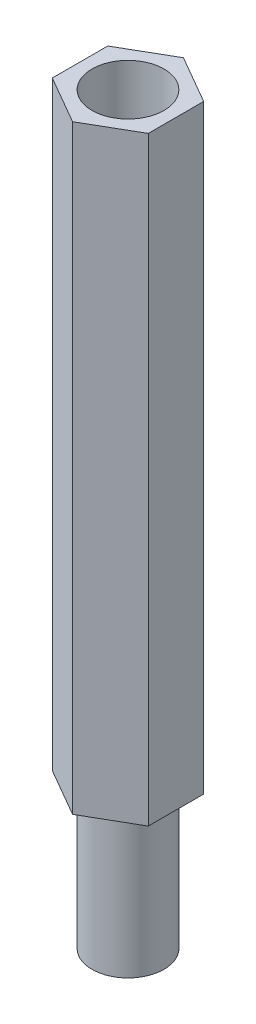
ISO-10303-21;
HEADER;
FILE_DESCRIPTION(('STEP AP214'),'2;1');
FILE_NAME('part.step','',(''),(''),'','','');
FILE_SCHEMA(('AUTOMOTIVE_DESIGN { 1 0 10303 214 1 1 1 1 }'));
ENDSEC;
DATA;
#1=APPLICATION_CONTEXT('core data for automotive mechanical design processes');
#2=APPLICATION_PROTOCOL_DEFINITION('international standard','automotive_design',2000,#1);
#3=PRODUCT_CONTEXT('',#1,'mechanical');
#4=PRODUCT('Part','Part','',(#3));
#5=PRODUCT_RELATED_PRODUCT_CATEGORY('part','',(#4));
#6=PRODUCT_DEFINITION_FORMATION('','',#4);
#7=PRODUCT_DEFINITION_CONTEXT('part definition',#1,'design');
#8=PRODUCT_DEFINITION('design','',#6,#7);
#9=PRODUCT_DEFINITION_SHAPE('','',#8);
#10=(LENGTH_UNIT() NAMED_UNIT(*) SI_UNIT(.MILLI.,.METRE.));
#11=(NAMED_UNIT(*) PLANE_ANGLE_UNIT() SI_UNIT($,.RADIAN.));
#12=(NAMED_UNIT(*) SI_UNIT($,.STERADIAN.) SOLID_ANGLE_UNIT());
#13=UNCERTAINTY_MEASURE_WITH_UNIT(LENGTH_MEASURE(1.E-05),#10,'distance_accuracy_value','');
#14=(GEOMETRIC_REPRESENTATION_CONTEXT(3) GLOBAL_UNCERTAINTY_ASSIGNED_CONTEXT((#13)) GLOBAL_UNIT_ASSIGNED_CONTEXT((#10,
#11,#12)) REPRESENTATION_CONTEXT('',''));
#15=CARTESIAN_POINT('',(0.,0.,0.));
#16=DIRECTION('',(0.,0.,1.));
#17=DIRECTION('',(1.,0.,0.));
#18=AXIS2_PLACEMENT_3D('',#15,#16,#17);
#19=CARTESIAN_POINT('',(-2.,25.,1.15470053837925));
#20=DIRECTION('',(0.5,0.,-0.866025403784439));
#21=DIRECTION('',(-0.866025403784439,0.,-0.5));
#22=AXIS2_PLACEMENT_3D('',#19,#20,#21);
#23=PLANE('',#22);
#24=DIRECTION('',(0.866025403784439,0.,0.5));
#25=VECTOR('',#24,1.);
#26=CARTESIAN_POINT('',(-2.,0.,1.15470053837925));
#27=LINE('',#26,#25);
#28=CARTESIAN_POINT('',(-2.,0.,1.15470053837925));
#29=VERTEX_POINT('',#28);
#30=CARTESIAN_POINT('',(0.,0.,2.3094010767585));
#31=VERTEX_POINT('',#30);
#32=EDGE_CURVE('E133',#29,#31,#27,.T.);
#33=ORIENTED_EDGE('',*,*,#32,.T.);
#34=DIRECTION('',(0.,-1.,0.));
#35=VECTOR('',#34,1.);
#36=CARTESIAN_POINT('',(0.,25.,2.3094010767585));
#37=LINE('',#36,#35);
#38=CARTESIAN_POINT('',(0.,25.,2.3094010767585));
#39=VERTEX_POINT('',#38);
#40=EDGE_CURVE('E50',#39,#31,#37,.T.);
#41=ORIENTED_EDGE('',*,*,#40,.F.);
#42=DIRECTION('',(0.866025403784439,0.,0.5));
#43=VECTOR('',#42,1.);
#44=CARTESIAN_POINT('',(-2.,25.,1.15470053837925));
#45=LINE('',#44,#43);
#46=CARTESIAN_POINT('',(-2.,25.,1.15470053837925));
#47=VERTEX_POINT('',#46);
#48=EDGE_CURVE('E144',#47,#39,#45,.T.);
#49=ORIENTED_EDGE('',*,*,#48,.F.);
#50=DIRECTION('',(0.,-1.,0.));
#51=VECTOR('',#50,1.);
#52=CARTESIAN_POINT('',(-2.,25.,1.15470053837925));
#53=LINE('',#52,#51);
#54=EDGE_CURVE('E129',#47,#29,#53,.T.);
#55=ORIENTED_EDGE('',*,*,#54,.T.);
#56=EDGE_LOOP('',(#33,#41,#49,#55));
#57=FACE_BOUND('',#56,.T.);
#58=ADVANCED_FACE('F47',(#57),#23,.F.);
#59=CARTESIAN_POINT('',(0.,25.,2.3094010767585));
#60=DIRECTION('',(-0.5,0.,-0.866025403784438));
#61=DIRECTION('',(-0.866025403784439,0.,0.5));
#62=AXIS2_PLACEMENT_3D('',#59,#60,#61);
#63=PLANE('',#62);
#64=DIRECTION('',(0.866025403784438,0.,-0.5));
#65=VECTOR('',#64,1.);
#66=CARTESIAN_POINT('',(0.,0.,2.3094010767585));
#67=LINE('',#66,#65);
#68=CARTESIAN_POINT('',(2.,0.,1.15470053837925));
#69=VERTEX_POINT('',#68);
#70=EDGE_CURVE('E136',#31,#69,#67,.T.);
#71=ORIENTED_EDGE('',*,*,#70,.T.);
#72=DIRECTION('',(0.,-1.,0.));
#73=VECTOR('',#72,1.);
#74=CARTESIAN_POINT('',(2.,25.,1.15470053837925));
#75=LINE('',#74,#73);
#76=CARTESIAN_POINT('',(2.,25.,1.15470053837925));
#77=VERTEX_POINT('',#76);
#78=EDGE_CURVE('E147',#77,#69,#75,.T.);
#79=ORIENTED_EDGE('',*,*,#78,.F.);
#80=DIRECTION('',(0.866025403784438,0.,-0.5));
#81=VECTOR('',#80,1.);
#82=CARTESIAN_POINT('',(0.,25.,2.3094010767585));
#83=LINE('',#82,#81);
#84=EDGE_CURVE('E102',#39,#77,#83,.T.);
#85=ORIENTED_EDGE('',*,*,#84,.F.);
#86=ORIENTED_EDGE('',*,*,#40,.T.);
#87=EDGE_LOOP('',(#71,#79,#85,#86));
#88=FACE_BOUND('',#87,.T.);
#89=ADVANCED_FACE('F152',(#88),#63,.F.);
#90=CARTESIAN_POINT('',(2.,25.,1.15470053837925));
#91=DIRECTION('',(-1.,0.,0.));
#92=DIRECTION('',(0.,0.,1.));
#93=AXIS2_PLACEMENT_3D('',#90,#91,#92);
#94=PLANE('',#93);
#95=DIRECTION('',(0.,0.,-1.));
#96=VECTOR('',#95,1.);
#97=CARTESIAN_POINT('',(2.,0.,1.15470053837925));
#98=LINE('',#97,#96);
#99=CARTESIAN_POINT('',(2.,0.,-1.15470053837925));
#100=VERTEX_POINT('',#99);
#101=EDGE_CURVE('E139',#69,#100,#98,.T.);
#102=ORIENTED_EDGE('',*,*,#101,.T.);
#103=DIRECTION('',(0.,-1.,0.));
#104=VECTOR('',#103,1.);
#105=CARTESIAN_POINT('',(2.,25.,-1.15470053837925));
#106=LINE('',#105,#104);
#107=CARTESIAN_POINT('',(2.,25.,-1.15470053837925));
#108=VERTEX_POINT('',#107);
#109=EDGE_CURVE('E124',#108,#100,#106,.T.);
#110=ORIENTED_EDGE('',*,*,#109,.F.);
#111=DIRECTION('',(0.,0.,-1.));
#112=VECTOR('',#111,1.);
#113=CARTESIAN_POINT('',(2.,25.,1.15470053837925));
#114=LINE('',#113,#112);
#115=EDGE_CURVE('E115',#77,#108,#114,.T.);
#116=ORIENTED_EDGE('',*,*,#115,.F.);
#117=ORIENTED_EDGE('',*,*,#78,.T.);
#118=EDGE_LOOP('',(#102,#110,#116,#117));
#119=FACE_BOUND('',#118,.T.);
#120=ADVANCED_FACE('F158',(#119),#94,.F.);
#121=CARTESIAN_POINT('',(2.,25.,-1.15470053837925));
#122=DIRECTION('',(-0.5,0.,0.866025403784439));
#123=DIRECTION('',(0.866025403784439,0.,0.5));
#124=AXIS2_PLACEMENT_3D('',#121,#122,#123);
#125=PLANE('',#124);
#126=DIRECTION('',(-0.866025403784439,0.,-0.5));
#127=VECTOR('',#126,1.);
#128=CARTESIAN_POINT('',(2.,0.,-1.15470053837925));
#129=LINE('',#128,#127);
#130=CARTESIAN_POINT('',(0.,0.,-2.3094010767585));
#131=VERTEX_POINT('',#130);
#132=EDGE_CURVE('E123',#100,#131,#129,.T.);
#133=ORIENTED_EDGE('',*,*,#132,.T.);
#134=DIRECTION('',(0.,-1.,0.));
#135=VECTOR('',#134,1.);
#136=CARTESIAN_POINT('',(0.,25.,-2.3094010767585));
#137=LINE('',#136,#135);
#138=CARTESIAN_POINT('',(0.,25.,-2.3094010767585));
#139=VERTEX_POINT('',#138);
#140=EDGE_CURVE('E120',#139,#131,#137,.T.);
#141=ORIENTED_EDGE('',*,*,#140,.F.);
#142=DIRECTION('',(-0.866025403784439,0.,-0.5));
#143=VECTOR('',#142,1.);
#144=CARTESIAN_POINT('',(2.,25.,-1.15470053837925));
#145=LINE('',#144,#143);
#146=EDGE_CURVE('E109',#108,#139,#145,.T.);
#147=ORIENTED_EDGE('',*,*,#146,.F.);
#148=ORIENTED_EDGE('',*,*,#109,.T.);
#149=EDGE_LOOP('',(#133,#141,#147,#148));
#150=FACE_BOUND('',#149,.T.);
#151=ADVANCED_FACE('F121',(#150),#125,.F.);
#152=CARTESIAN_POINT('',(0.,25.,-2.3094010767585));
#153=DIRECTION('',(0.5,0.,0.866025403784438));
#154=DIRECTION('',(0.866025403784438,0.,-0.5));
#155=AXIS2_PLACEMENT_3D('',#152,#153,#154);
#156=PLANE('',#155);
#157=DIRECTION('',(-0.866025403784439,0.,0.5));
#158=VECTOR('',#157,1.);
#159=CARTESIAN_POINT('',(0.,0.,-2.3094010767585));
#160=LINE('',#159,#158);
#161=CARTESIAN_POINT('',(-2.,0.,-1.15470053837925));
#162=VERTEX_POINT('',#161);
#163=EDGE_CURVE('E87',#131,#162,#160,.T.);
#164=ORIENTED_EDGE('',*,*,#163,.T.);
#165=DIRECTION('',(0.,-1.,0.));
#166=VECTOR('',#165,1.);
#167=CARTESIAN_POINT('',(-2.,25.,-1.15470053837925));
#168=LINE('',#167,#166);
#169=CARTESIAN_POINT('',(-2.,25.,-1.15470053837925));
#170=VERTEX_POINT('',#169);
#171=EDGE_CURVE('E125',#170,#162,#168,.T.);
#172=ORIENTED_EDGE('',*,*,#171,.F.);
#173=DIRECTION('',(-0.866025403784439,0.,0.5));
#174=VECTOR('',#173,1.);
#175=CARTESIAN_POINT('',(0.,25.,-2.3094010767585));
#176=LINE('',#175,#174);
#177=EDGE_CURVE('E113',#139,#170,#176,.T.);
#178=ORIENTED_EDGE('',*,*,#177,.F.);
#179=ORIENTED_EDGE('',*,*,#140,.T.);
#180=EDGE_LOOP('',(#164,#172,#178,#179));
#181=FACE_BOUND('',#180,.T.);
#182=ADVANCED_FACE('F127',(#181),#156,.F.);
#183=CARTESIAN_POINT('',(-2.,25.,-1.15470053837925));
#184=DIRECTION('',(1.,0.,0.));
#185=DIRECTION('',(0.,0.,-1.));
#186=AXIS2_PLACEMENT_3D('',#183,#184,#185);
#187=PLANE('',#186);
#188=DIRECTION('',(0.,0.,1.));
#189=VECTOR('',#188,1.);
#190=CARTESIAN_POINT('',(-2.,0.,-1.15470053837925));
#191=LINE('',#190,#189);
#192=EDGE_CURVE('E93',#162,#29,#191,.T.);
#193=ORIENTED_EDGE('',*,*,#192,.T.);
#194=ORIENTED_EDGE('',*,*,#54,.F.);
#195=DIRECTION('',(0.,0.,1.));
#196=VECTOR('',#195,1.);
#197=CARTESIAN_POINT('',(-2.,25.,-1.15470053837925));
#198=LINE('',#197,#196);
#199=EDGE_CURVE('E64',#170,#47,#198,.T.);
#200=ORIENTED_EDGE('',*,*,#199,.F.);
#201=ORIENTED_EDGE('',*,*,#171,.T.);
#202=EDGE_LOOP('',(#193,#194,#200,#201));
#203=FACE_BOUND('',#202,.T.);
#204=ADVANCED_FACE('F220',(#203),#187,.F.);
#205=CARTESIAN_POINT('',(0.,25.,0.));
#206=DIRECTION('',(0.,1.,0.));
#207=DIRECTION('',(0.,0.,1.));
#208=AXIS2_PLACEMENT_3D('',#205,#206,#207);
#209=PLANE('',#208);
#210=CARTESIAN_POINT('',(0.,25.,0.));
#211=DIRECTION('',(0.,1.,0.));
#212=DIRECTION('',(0.,0.,1.));
#213=AXIS2_PLACEMENT_3D('',#210,#211,#212);
#214=CIRCLE('',#213,1.5);
#215=CARTESIAN_POINT('',(0.,25.,1.5));
#216=VERTEX_POINT('',#215);
#217=EDGE_CURVE('E161',#216,#216,#214,.T.);
#218=ORIENTED_EDGE('',*,*,#217,.F.);
#219=EDGE_LOOP('',(#218));
#220=FACE_BOUND('',#219,.T.);
#221=ORIENTED_EDGE('',*,*,#48,.T.);
#222=ORIENTED_EDGE('',*,*,#84,.T.);
#223=ORIENTED_EDGE('',*,*,#115,.T.);
#224=ORIENTED_EDGE('',*,*,#146,.T.);
#225=ORIENTED_EDGE('',*,*,#177,.T.);
#226=ORIENTED_EDGE('',*,*,#199,.T.);
#227=EDGE_LOOP('',(#221,#222,#223,#224,#225,#226));
#228=FACE_BOUND('',#227,.T.);
#229=ADVANCED_FACE('F111',(#220,#228),#209,.T.);
#230=CARTESIAN_POINT('',(0.,0.,0.));
#231=DIRECTION('',(0.,1.,0.));
#232=DIRECTION('',(0.,0.,1.));
#233=AXIS2_PLACEMENT_3D('',#230,#231,#232);
#234=PLANE('',#233);
#235=CARTESIAN_POINT('',(0.,0.,0.));
#236=DIRECTION('',(0.,-1.,0.));
#237=DIRECTION('',(0.,0.,-1.));
#238=AXIS2_PLACEMENT_3D('',#235,#236,#237);
#239=CIRCLE('',#238,1.5);
#240=CARTESIAN_POINT('',(0.,0.,-1.5));
#241=VERTEX_POINT('',#240);
#242=EDGE_CURVE('E12',#241,#241,#239,.T.);
#243=ORIENTED_EDGE('',*,*,#242,.F.);
#244=EDGE_LOOP('',(#243));
#245=FACE_BOUND('',#244,.T.);
#246=ORIENTED_EDGE('',*,*,#32,.F.);
#247=ORIENTED_EDGE('',*,*,#192,.F.);
#248=ORIENTED_EDGE('',*,*,#163,.F.);
#249=ORIENTED_EDGE('',*,*,#132,.F.);
#250=ORIENTED_EDGE('',*,*,#101,.F.);
#251=ORIENTED_EDGE('',*,*,#70,.F.);
#252=EDGE_LOOP('',(#246,#247,#248,#249,#250,#251));
#253=FACE_BOUND('',#252,.T.);
#254=ADVANCED_FACE('F157',(#245,#253),#234,.F.);
#255=CARTESIAN_POINT('',(0.,6.,0.));
#256=DIRECTION('',(0.,1.,0.));
#257=DIRECTION('',(0.,0.,1.));
#258=AXIS2_PLACEMENT_3D('',#255,#256,#257);
#259=CYLINDRICAL_SURFACE('',#258,1.5);
#260=CARTESIAN_POINT('',(0.,6.,0.));
#261=DIRECTION('',(0.,1.,0.));
#262=DIRECTION('',(0.,0.,1.));
#263=AXIS2_PLACEMENT_3D('',#260,#261,#262);
#264=CIRCLE('',#263,1.5);
#265=CARTESIAN_POINT('',(0.,6.,1.5));
#266=VERTEX_POINT('',#265);
#267=EDGE_CURVE('E137',#266,#266,#264,.T.);
#268=ORIENTED_EDGE('',*,*,#267,.F.);
#269=EDGE_LOOP('',(#268));
#270=FACE_BOUND('',#269,.T.);
#271=ORIENTED_EDGE('',*,*,#217,.T.);
#272=EDGE_LOOP('',(#271));
#273=FACE_BOUND('',#272,.T.);
#274=ADVANCED_FACE('F212',(#270,#273),#259,.F.);
#275=CARTESIAN_POINT('',(0.,6.,0.));
#276=DIRECTION('',(0.,1.,0.));
#277=DIRECTION('',(0.,0.,1.));
#278=AXIS2_PLACEMENT_3D('',#275,#276,#277);
#279=PLANE('',#278);
#280=ORIENTED_EDGE('',*,*,#267,.T.);
#281=EDGE_LOOP('',(#280));
#282=FACE_BOUND('',#281,.T.);
#283=ADVANCED_FACE('F207',(#282),#279,.T.);
#284=CARTESIAN_POINT('',(0.,-6.,0.));
#285=DIRECTION('',(0.,1.,0.));
#286=DIRECTION('',(0.,0.,1.));
#287=AXIS2_PLACEMENT_3D('',#284,#285,#286);
#288=CYLINDRICAL_SURFACE('',#287,1.5);
#289=CARTESIAN_POINT('',(0.,-6.,0.));
#290=DIRECTION('',(0.,-1.,0.));
#291=DIRECTION('',(0.,0.,-1.));
#292=AXIS2_PLACEMENT_3D('',#289,#290,#291);
#293=CIRCLE('',#292,1.5);
#294=CARTESIAN_POINT('',(0.,-6.,-1.5));
#295=VERTEX_POINT('',#294);
#296=EDGE_CURVE('E166',#295,#295,#293,.T.);
#297=ORIENTED_EDGE('',*,*,#296,.F.);
#298=EDGE_LOOP('',(#297));
#299=FACE_BOUND('',#298,.T.);
#300=ORIENTED_EDGE('',*,*,#242,.T.);
#301=EDGE_LOOP('',(#300));
#302=FACE_BOUND('',#301,.T.);
#303=ADVANCED_FACE('F204',(#299,#302),#288,.T.);
#304=CARTESIAN_POINT('',(0.,-6.,0.));
#305=DIRECTION('',(0.,-1.,0.));
#306=DIRECTION('',(0.,0.,-1.));
#307=AXIS2_PLACEMENT_3D('',#304,#305,#306);
#308=PLANE('',#307);
#309=ORIENTED_EDGE('',*,*,#296,.T.);
#310=EDGE_LOOP('',(#309));
#311=FACE_BOUND('',#310,.T.);
#312=ADVANCED_FACE('F202',(#311),#308,.T.);
#313=CLOSED_SHELL('',(#58,#89,#120,#151,#182,#204,#229,#254,#274,#283,#303,#312));
#314=MANIFOLD_SOLID_BREP('B2',#313);
#315=ADVANCED_BREP_SHAPE_REPRESENTATION('',(#18,#314),#14);
#316=SHAPE_DEFINITION_REPRESENTATION(#9,#315);
ENDSEC;
END-ISO-10303-21;
